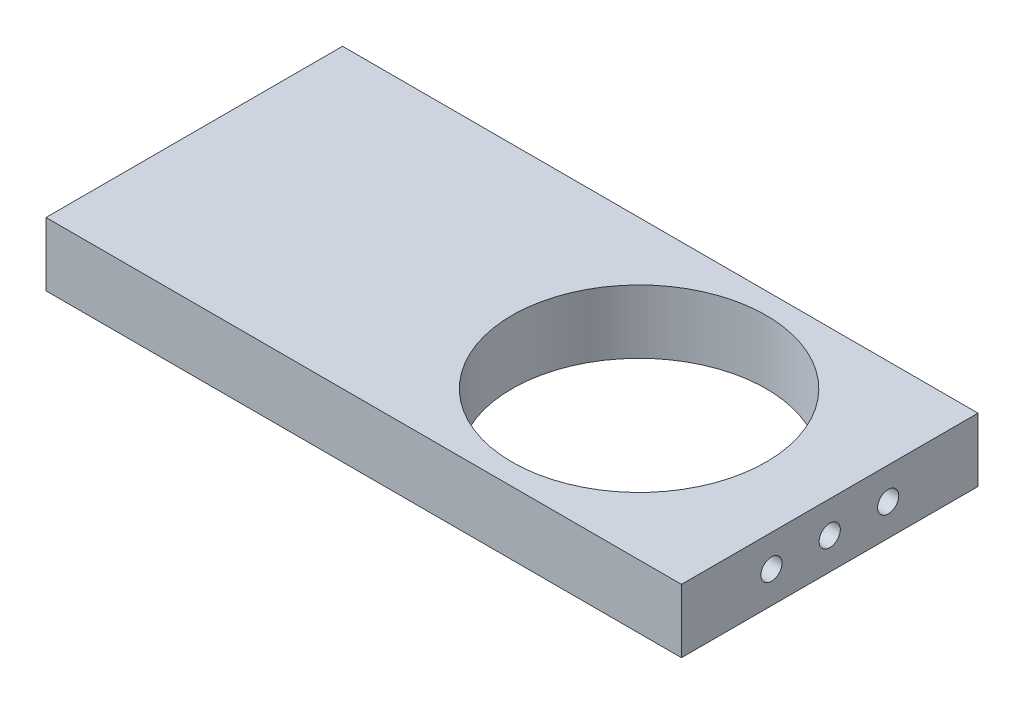
ISO-10303-21;
HEADER;
FILE_DESCRIPTION(('STEP AP214'),'2;1');
FILE_NAME('part.step','',(''),(''),'','','');
FILE_SCHEMA(('AUTOMOTIVE_DESIGN { 1 0 10303 214 1 1 1 1 }'));
ENDSEC;
DATA;
#1=APPLICATION_CONTEXT('core data for automotive mechanical design processes');
#2=APPLICATION_PROTOCOL_DEFINITION('international standard','automotive_design',2000,#1);
#3=PRODUCT_CONTEXT('',#1,'mechanical');
#4=PRODUCT('Part','Part','',(#3));
#5=PRODUCT_RELATED_PRODUCT_CATEGORY('part','',(#4));
#6=PRODUCT_DEFINITION_FORMATION('','',#4);
#7=PRODUCT_DEFINITION_CONTEXT('part definition',#1,'design');
#8=PRODUCT_DEFINITION('design','',#6,#7);
#9=PRODUCT_DEFINITION_SHAPE('','',#8);
#10=(LENGTH_UNIT() NAMED_UNIT(*) SI_UNIT(.MILLI.,.METRE.));
#11=(NAMED_UNIT(*) PLANE_ANGLE_UNIT() SI_UNIT($,.RADIAN.));
#12=(NAMED_UNIT(*) SI_UNIT($,.STERADIAN.) SOLID_ANGLE_UNIT());
#13=UNCERTAINTY_MEASURE_WITH_UNIT(LENGTH_MEASURE(1.E-05),#10,'distance_accuracy_value','');
#14=(GEOMETRIC_REPRESENTATION_CONTEXT(3) GLOBAL_UNCERTAINTY_ASSIGNED_CONTEXT((#13)) GLOBAL_UNIT_ASSIGNED_CONTEXT((#10,
#11,#12)) REPRESENTATION_CONTEXT('',''));
#15=CARTESIAN_POINT('',(0.,0.,0.));
#16=DIRECTION('',(0.,0.,1.));
#17=DIRECTION('',(1.,0.,0.));
#18=AXIS2_PLACEMENT_3D('',#15,#16,#17);
#19=CARTESIAN_POINT('',(-95.25,9.525,-44.45));
#20=DIRECTION('',(1.,0.,0.));
#21=DIRECTION('',(0.,0.,-1.));
#22=AXIS2_PLACEMENT_3D('',#19,#20,#21);
#23=PLANE('',#22);
#24=CARTESIAN_POINT('',(-95.25,0.,17.4625));
#25=DIRECTION('',(1.,0.,0.));
#26=DIRECTION('',(0.,0.,-1.));
#27=AXIS2_PLACEMENT_3D('',#24,#25,#26);
#28=CIRCLE('',#27,3.175);
#29=CARTESIAN_POINT('',(-95.25,0.,14.2875));
#30=VERTEX_POINT('',#29);
#31=EDGE_CURVE('E142',#30,#30,#28,.T.);
#32=ORIENTED_EDGE('',*,*,#31,.T.);
#33=EDGE_LOOP('',(#32));
#34=FACE_BOUND('',#33,.T.);
#35=DIRECTION('',(0.,0.,1.));
#36=VECTOR('',#35,1.);
#37=CARTESIAN_POINT('',(-95.25,-9.525,-44.45));
#38=LINE('',#37,#36);
#39=CARTESIAN_POINT('',(-95.25,-9.525,-44.45));
#40=VERTEX_POINT('',#39);
#41=CARTESIAN_POINT('',(-95.25,-9.525,44.45));
#42=VERTEX_POINT('',#41);
#43=EDGE_CURVE('E66',#40,#42,#38,.T.);
#44=ORIENTED_EDGE('',*,*,#43,.T.);
#45=DIRECTION('',(0.,-1.,0.));
#46=VECTOR('',#45,1.);
#47=CARTESIAN_POINT('',(-95.25,9.525,44.45));
#48=LINE('',#47,#46);
#49=CARTESIAN_POINT('',(-95.25,9.525,44.45));
#50=VERTEX_POINT('',#49);
#51=EDGE_CURVE('E90',#50,#42,#48,.T.);
#52=ORIENTED_EDGE('',*,*,#51,.F.);
#53=DIRECTION('',(0.,0.,1.));
#54=VECTOR('',#53,1.);
#55=CARTESIAN_POINT('',(-95.25,9.525,-44.45));
#56=LINE('',#55,#54);
#57=CARTESIAN_POINT('',(-95.25,9.525,-44.45));
#58=VERTEX_POINT('',#57);
#59=EDGE_CURVE('E83',#58,#50,#56,.T.);
#60=ORIENTED_EDGE('',*,*,#59,.F.);
#61=DIRECTION('',(0.,-1.,0.));
#62=VECTOR('',#61,1.);
#63=CARTESIAN_POINT('',(-95.25,9.525,-44.45));
#64=LINE('',#63,#62);
#65=EDGE_CURVE('E41',#58,#40,#64,.T.);
#66=ORIENTED_EDGE('',*,*,#65,.T.);
#67=EDGE_LOOP('',(#44,#52,#60,#66));
#68=FACE_BOUND('',#67,.T.);
#69=CARTESIAN_POINT('',(-95.25,0.,0.));
#70=DIRECTION('',(1.,0.,0.));
#71=DIRECTION('',(0.,0.,-1.));
#72=AXIS2_PLACEMENT_3D('',#69,#70,#71);
#73=CIRCLE('',#72,3.175);
#74=CARTESIAN_POINT('',(-95.25,0.,-3.175));
#75=VERTEX_POINT('',#74);
#76=EDGE_CURVE('E136',#75,#75,#73,.T.);
#77=ORIENTED_EDGE('',*,*,#76,.T.);
#78=EDGE_LOOP('',(#77));
#79=FACE_BOUND('',#78,.T.);
#80=CARTESIAN_POINT('',(-95.25,0.,-17.526));
#81=DIRECTION('',(1.,0.,0.));
#82=DIRECTION('',(0.,0.,-1.));
#83=AXIS2_PLACEMENT_3D('',#80,#81,#82);
#84=CIRCLE('',#83,3.175);
#85=CARTESIAN_POINT('',(-95.25,0.,-20.701));
#86=VERTEX_POINT('',#85);
#87=EDGE_CURVE('E148',#86,#86,#84,.T.);
#88=ORIENTED_EDGE('',*,*,#87,.T.);
#89=EDGE_LOOP('',(#88));
#90=FACE_BOUND('',#89,.T.);
#91=ADVANCED_FACE('F32',(#34,#68,#79,#90),#23,.F.);
#92=CARTESIAN_POINT('',(0.,9.525,0.));
#93=DIRECTION('',(0.,1.,0.));
#94=DIRECTION('',(0.,0.,1.));
#95=AXIS2_PLACEMENT_3D('',#92,#93,#94);
#96=PLANE('',#95);
#97=DIRECTION('',(0.,0.,-1.));
#98=VECTOR('',#97,1.);
#99=CARTESIAN_POINT('',(95.25,9.525,-44.45));
#100=LINE('',#99,#98);
#101=CARTESIAN_POINT('',(95.25,9.525,44.45));
#102=VERTEX_POINT('',#101);
#103=CARTESIAN_POINT('',(95.25,9.525,-44.45));
#104=VERTEX_POINT('',#103);
#105=EDGE_CURVE('E85',#102,#104,#100,.T.);
#106=ORIENTED_EDGE('',*,*,#105,.T.);
#107=DIRECTION('',(-1.,0.,0.));
#108=VECTOR('',#107,1.);
#109=CARTESIAN_POINT('',(-95.25,9.525,-44.45));
#110=LINE('',#109,#108);
#111=EDGE_CURVE('E79',#104,#58,#110,.T.);
#112=ORIENTED_EDGE('',*,*,#111,.T.);
#113=ORIENTED_EDGE('',*,*,#59,.T.);
#114=DIRECTION('',(1.,0.,0.));
#115=VECTOR('',#114,1.);
#116=CARTESIAN_POINT('',(-95.25,9.525,44.45));
#117=LINE('',#116,#115);
#118=EDGE_CURVE('E49',#50,#102,#117,.T.);
#119=ORIENTED_EDGE('',*,*,#118,.T.);
#120=EDGE_LOOP('',(#106,#112,#113,#119));
#121=FACE_BOUND('',#120,.T.);
#122=CARTESIAN_POINT('',(38.1,9.525,0.));
#123=DIRECTION('',(0.,1.,0.));
#124=DIRECTION('',(0.,0.,1.));
#125=AXIS2_PLACEMENT_3D('',#122,#123,#124);
#126=CIRCLE('',#125,38.1);
#127=CARTESIAN_POINT('',(38.1,9.525,38.1));
#128=VERTEX_POINT('',#127);
#129=EDGE_CURVE('E100',#128,#128,#126,.T.);
#130=ORIENTED_EDGE('',*,*,#129,.F.);
#131=EDGE_LOOP('',(#130));
#132=FACE_BOUND('',#131,.T.);
#133=ADVANCED_FACE('F80',(#121,#132),#96,.T.);
#134=CARTESIAN_POINT('',(0.,-9.525,0.));
#135=DIRECTION('',(0.,1.,0.));
#136=DIRECTION('',(0.,0.,1.));
#137=AXIS2_PLACEMENT_3D('',#134,#135,#136);
#138=PLANE('',#137);
#139=DIRECTION('',(0.,0.,-1.));
#140=VECTOR('',#139,1.);
#141=CARTESIAN_POINT('',(95.25,-9.525,-44.45));
#142=LINE('',#141,#140);
#143=CARTESIAN_POINT('',(95.25,-9.525,44.45));
#144=VERTEX_POINT('',#143);
#145=CARTESIAN_POINT('',(95.25,-9.525,-44.45));
#146=VERTEX_POINT('',#145);
#147=EDGE_CURVE('E97',#144,#146,#142,.T.);
#148=ORIENTED_EDGE('',*,*,#147,.F.);
#149=DIRECTION('',(1.,0.,0.));
#150=VECTOR('',#149,1.);
#151=CARTESIAN_POINT('',(-95.25,-9.525,44.45));
#152=LINE('',#151,#150);
#153=EDGE_CURVE('E72',#42,#144,#152,.T.);
#154=ORIENTED_EDGE('',*,*,#153,.F.);
#155=ORIENTED_EDGE('',*,*,#43,.F.);
#156=DIRECTION('',(-1.,0.,0.));
#157=VECTOR('',#156,1.);
#158=CARTESIAN_POINT('',(-95.25,-9.525,-44.45));
#159=LINE('',#158,#157);
#160=EDGE_CURVE('E89',#146,#40,#159,.T.);
#161=ORIENTED_EDGE('',*,*,#160,.F.);
#162=EDGE_LOOP('',(#148,#154,#155,#161));
#163=FACE_BOUND('',#162,.T.);
#164=CARTESIAN_POINT('',(38.1,-9.525,0.));
#165=DIRECTION('',(0.,1.,0.));
#166=DIRECTION('',(0.,0.,1.));
#167=AXIS2_PLACEMENT_3D('',#164,#165,#166);
#168=CIRCLE('',#167,38.1);
#169=CARTESIAN_POINT('',(38.1,-9.525,38.1));
#170=VERTEX_POINT('',#169);
#171=EDGE_CURVE('E112',#170,#170,#168,.T.);
#172=ORIENTED_EDGE('',*,*,#171,.T.);
#173=EDGE_LOOP('',(#172));
#174=FACE_BOUND('',#173,.T.);
#175=ADVANCED_FACE('F108',(#163,#174),#138,.F.);
#176=CARTESIAN_POINT('',(95.25,9.525,-44.45));
#177=DIRECTION('',(-1.,0.,0.));
#178=DIRECTION('',(0.,0.,1.));
#179=AXIS2_PLACEMENT_3D('',#176,#177,#178);
#180=PLANE('',#179);
#181=CARTESIAN_POINT('',(95.25,0.,-17.526));
#182=DIRECTION('',(1.,0.,0.));
#183=DIRECTION('',(0.,0.,-1.));
#184=AXIS2_PLACEMENT_3D('',#181,#182,#183);
#185=CIRCLE('',#184,3.175);
#186=CARTESIAN_POINT('',(95.25,0.,-20.701));
#187=VERTEX_POINT('',#186);
#188=EDGE_CURVE('E130',#187,#187,#185,.T.);
#189=ORIENTED_EDGE('',*,*,#188,.F.);
#190=EDGE_LOOP('',(#189));
#191=FACE_BOUND('',#190,.T.);
#192=CARTESIAN_POINT('',(95.25,0.,17.4625));
#193=DIRECTION('',(1.,0.,0.));
#194=DIRECTION('',(0.,0.,-1.));
#195=AXIS2_PLACEMENT_3D('',#192,#193,#194);
#196=CIRCLE('',#195,3.175);
#197=CARTESIAN_POINT('',(95.25,0.,14.2875));
#198=VERTEX_POINT('',#197);
#199=EDGE_CURVE('E124',#198,#198,#196,.T.);
#200=ORIENTED_EDGE('',*,*,#199,.F.);
#201=EDGE_LOOP('',(#200));
#202=FACE_BOUND('',#201,.T.);
#203=CARTESIAN_POINT('',(95.25,0.,0.));
#204=DIRECTION('',(1.,0.,0.));
#205=DIRECTION('',(0.,0.,-1.));
#206=AXIS2_PLACEMENT_3D('',#203,#204,#205);
#207=CIRCLE('',#206,3.175);
#208=CARTESIAN_POINT('',(95.25,0.,-3.175));
#209=VERTEX_POINT('',#208);
#210=EDGE_CURVE('E118',#209,#209,#207,.T.);
#211=ORIENTED_EDGE('',*,*,#210,.F.);
#212=EDGE_LOOP('',(#211));
#213=FACE_BOUND('',#212,.T.);
#214=ORIENTED_EDGE('',*,*,#147,.T.);
#215=DIRECTION('',(0.,-1.,0.));
#216=VECTOR('',#215,1.);
#217=CARTESIAN_POINT('',(95.25,9.525,-44.45));
#218=LINE('',#217,#216);
#219=EDGE_CURVE('E11',#104,#146,#218,.T.);
#220=ORIENTED_EDGE('',*,*,#219,.F.);
#221=ORIENTED_EDGE('',*,*,#105,.F.);
#222=DIRECTION('',(0.,-1.,0.));
#223=VECTOR('',#222,1.);
#224=CARTESIAN_POINT('',(95.25,9.525,44.45));
#225=LINE('',#224,#223);
#226=EDGE_CURVE('E93',#102,#144,#225,.T.);
#227=ORIENTED_EDGE('',*,*,#226,.T.);
#228=EDGE_LOOP('',(#214,#220,#221,#227));
#229=FACE_BOUND('',#228,.T.);
#230=ADVANCED_FACE('F34',(#191,#202,#213,#229),#180,.F.);
#231=CARTESIAN_POINT('',(-95.25,9.525,-44.45));
#232=DIRECTION('',(0.,0.,1.));
#233=DIRECTION('',(1.,0.,0.));
#234=AXIS2_PLACEMENT_3D('',#231,#232,#233);
#235=PLANE('',#234);
#236=ORIENTED_EDGE('',*,*,#160,.T.);
#237=ORIENTED_EDGE('',*,*,#65,.F.);
#238=ORIENTED_EDGE('',*,*,#111,.F.);
#239=ORIENTED_EDGE('',*,*,#219,.T.);
#240=EDGE_LOOP('',(#236,#237,#238,#239));
#241=FACE_BOUND('',#240,.T.);
#242=ADVANCED_FACE('F88',(#241),#235,.F.);
#243=CARTESIAN_POINT('',(-95.25,9.525,44.45));
#244=DIRECTION('',(0.,0.,-1.));
#245=DIRECTION('',(-1.,0.,0.));
#246=AXIS2_PLACEMENT_3D('',#243,#244,#245);
#247=PLANE('',#246);
#248=ORIENTED_EDGE('',*,*,#153,.T.);
#249=ORIENTED_EDGE('',*,*,#226,.F.);
#250=ORIENTED_EDGE('',*,*,#118,.F.);
#251=ORIENTED_EDGE('',*,*,#51,.T.);
#252=EDGE_LOOP('',(#248,#249,#250,#251));
#253=FACE_BOUND('',#252,.T.);
#254=ADVANCED_FACE('F105',(#253),#247,.F.);
#255=CARTESIAN_POINT('',(38.1,9.525,0.));
#256=DIRECTION('',(0.,-1.,0.));
#257=DIRECTION('',(0.,0.,-1.));
#258=AXIS2_PLACEMENT_3D('',#255,#256,#257);
#259=CYLINDRICAL_SURFACE('',#258,38.1);
#260=ORIENTED_EDGE('',*,*,#129,.T.);
#261=EDGE_LOOP('',(#260));
#262=FACE_BOUND('',#261,.T.);
#263=ORIENTED_EDGE('',*,*,#171,.F.);
#264=EDGE_LOOP('',(#263));
#265=FACE_BOUND('',#264,.T.);
#266=ADVANCED_FACE('F179',(#262,#265),#259,.F.);
#267=CARTESIAN_POINT('',(82.55,0.,0.));
#268=DIRECTION('',(1.,0.,0.));
#269=DIRECTION('',(0.,0.,-1.));
#270=AXIS2_PLACEMENT_3D('',#267,#268,#269);
#271=CYLINDRICAL_SURFACE('',#270,3.175);
#272=CARTESIAN_POINT('',(82.55,0.,0.));
#273=DIRECTION('',(1.,0.,0.));
#274=DIRECTION('',(0.,0.,-1.));
#275=AXIS2_PLACEMENT_3D('',#272,#273,#274);
#276=CIRCLE('',#275,3.175);
#277=CARTESIAN_POINT('',(82.55,0.,-3.175));
#278=VERTEX_POINT('',#277);
#279=EDGE_CURVE('E115',#278,#278,#276,.T.);
#280=ORIENTED_EDGE('',*,*,#279,.F.);
#281=EDGE_LOOP('',(#280));
#282=FACE_BOUND('',#281,.T.);
#283=ORIENTED_EDGE('',*,*,#210,.T.);
#284=EDGE_LOOP('',(#283));
#285=FACE_BOUND('',#284,.T.);
#286=ADVANCED_FACE('F190',(#282,#285),#271,.F.);
#287=CARTESIAN_POINT('',(82.55,0.,0.));
#288=DIRECTION('',(1.,0.,0.));
#289=DIRECTION('',(0.,0.,-1.));
#290=AXIS2_PLACEMENT_3D('',#287,#288,#289);
#291=PLANE('',#290);
#292=ORIENTED_EDGE('',*,*,#279,.T.);
#293=EDGE_LOOP('',(#292));
#294=FACE_BOUND('',#293,.T.);
#295=ADVANCED_FACE('F192',(#294),#291,.T.);
#296=CARTESIAN_POINT('',(82.55,0.,17.4625));
#297=DIRECTION('',(1.,0.,0.));
#298=DIRECTION('',(0.,0.,-1.));
#299=AXIS2_PLACEMENT_3D('',#296,#297,#298);
#300=CYLINDRICAL_SURFACE('',#299,3.175);
#301=CARTESIAN_POINT('',(82.55,0.,17.4625));
#302=DIRECTION('',(1.,0.,0.));
#303=DIRECTION('',(0.,0.,-1.));
#304=AXIS2_PLACEMENT_3D('',#301,#302,#303);
#305=CIRCLE('',#304,3.175);
#306=CARTESIAN_POINT('',(82.55,0.,14.2875));
#307=VERTEX_POINT('',#306);
#308=EDGE_CURVE('E121',#307,#307,#305,.T.);
#309=ORIENTED_EDGE('',*,*,#308,.F.);
#310=EDGE_LOOP('',(#309));
#311=FACE_BOUND('',#310,.T.);
#312=ORIENTED_EDGE('',*,*,#199,.T.);
#313=EDGE_LOOP('',(#312));
#314=FACE_BOUND('',#313,.T.);
#315=ADVANCED_FACE('F199',(#311,#314),#300,.F.);
#316=CARTESIAN_POINT('',(82.55,0.,17.4625));
#317=DIRECTION('',(1.,0.,0.));
#318=DIRECTION('',(0.,0.,-1.));
#319=AXIS2_PLACEMENT_3D('',#316,#317,#318);
#320=PLANE('',#319);
#321=ORIENTED_EDGE('',*,*,#308,.T.);
#322=EDGE_LOOP('',(#321));
#323=FACE_BOUND('',#322,.T.);
#324=ADVANCED_FACE('F208',(#323),#320,.T.);
#325=CARTESIAN_POINT('',(82.55,0.,-17.526));
#326=DIRECTION('',(1.,0.,0.));
#327=DIRECTION('',(0.,0.,-1.));
#328=AXIS2_PLACEMENT_3D('',#325,#326,#327);
#329=CYLINDRICAL_SURFACE('',#328,3.175);
#330=CARTESIAN_POINT('',(82.55,0.,-17.526));
#331=DIRECTION('',(1.,0.,0.));
#332=DIRECTION('',(0.,0.,-1.));
#333=AXIS2_PLACEMENT_3D('',#330,#331,#332);
#334=CIRCLE('',#333,3.175);
#335=CARTESIAN_POINT('',(82.55,0.,-20.701));
#336=VERTEX_POINT('',#335);
#337=EDGE_CURVE('E127',#336,#336,#334,.T.);
#338=ORIENTED_EDGE('',*,*,#337,.F.);
#339=EDGE_LOOP('',(#338));
#340=FACE_BOUND('',#339,.T.);
#341=ORIENTED_EDGE('',*,*,#188,.T.);
#342=EDGE_LOOP('',(#341));
#343=FACE_BOUND('',#342,.T.);
#344=ADVANCED_FACE('F212',(#340,#343),#329,.F.);
#345=CARTESIAN_POINT('',(82.55,0.,-17.526));
#346=DIRECTION('',(1.,0.,0.));
#347=DIRECTION('',(0.,0.,-1.));
#348=AXIS2_PLACEMENT_3D('',#345,#346,#347);
#349=PLANE('',#348);
#350=ORIENTED_EDGE('',*,*,#337,.T.);
#351=EDGE_LOOP('',(#350));
#352=FACE_BOUND('',#351,.T.);
#353=ADVANCED_FACE('F216',(#352),#349,.T.);
#354=CARTESIAN_POINT('',(-82.55,0.,0.));
#355=DIRECTION('',(-1.,0.,0.));
#356=DIRECTION('',(0.,0.,1.));
#357=AXIS2_PLACEMENT_3D('',#354,#355,#356);
#358=CYLINDRICAL_SURFACE('',#357,3.175);
#359=CARTESIAN_POINT('',(-82.55,0.,0.));
#360=DIRECTION('',(1.,0.,0.));
#361=DIRECTION('',(0.,0.,-1.));
#362=AXIS2_PLACEMENT_3D('',#359,#360,#361);
#363=CIRCLE('',#362,3.175);
#364=CARTESIAN_POINT('',(-82.55,0.,-3.175));
#365=VERTEX_POINT('',#364);
#366=EDGE_CURVE('E133',#365,#365,#363,.T.);
#367=ORIENTED_EDGE('',*,*,#366,.T.);
#368=EDGE_LOOP('',(#367));
#369=FACE_BOUND('',#368,.T.);
#370=ORIENTED_EDGE('',*,*,#76,.F.);
#371=EDGE_LOOP('',(#370));
#372=FACE_BOUND('',#371,.T.);
#373=ADVANCED_FACE('F220',(#369,#372),#358,.F.);
#374=CARTESIAN_POINT('',(-82.55,0.,0.));
#375=DIRECTION('',(-1.,0.,0.));
#376=DIRECTION('',(0.,0.,-1.));
#377=AXIS2_PLACEMENT_3D('',#374,#375,#376);
#378=PLANE('',#377);
#379=ORIENTED_EDGE('',*,*,#366,.F.);
#380=EDGE_LOOP('',(#379));
#381=FACE_BOUND('',#380,.T.);
#382=ADVANCED_FACE('F224',(#381),#378,.T.);
#383=CARTESIAN_POINT('',(-82.55,0.,17.4625));
#384=DIRECTION('',(-1.,0.,0.));
#385=DIRECTION('',(0.,0.,1.));
#386=AXIS2_PLACEMENT_3D('',#383,#384,#385);
#387=CYLINDRICAL_SURFACE('',#386,3.175);
#388=CARTESIAN_POINT('',(-82.55,0.,17.4625));
#389=DIRECTION('',(1.,0.,0.));
#390=DIRECTION('',(0.,0.,-1.));
#391=AXIS2_PLACEMENT_3D('',#388,#389,#390);
#392=CIRCLE('',#391,3.175);
#393=CARTESIAN_POINT('',(-82.55,0.,14.2875));
#394=VERTEX_POINT('',#393);
#395=EDGE_CURVE('E139',#394,#394,#392,.T.);
#396=ORIENTED_EDGE('',*,*,#395,.T.);
#397=EDGE_LOOP('',(#396));
#398=FACE_BOUND('',#397,.T.);
#399=ORIENTED_EDGE('',*,*,#31,.F.);
#400=EDGE_LOOP('',(#399));
#401=FACE_BOUND('',#400,.T.);
#402=ADVANCED_FACE('F228',(#398,#401),#387,.F.);
#403=CARTESIAN_POINT('',(-82.55,0.,17.4625));
#404=DIRECTION('',(-1.,0.,0.));
#405=DIRECTION('',(0.,0.,-1.));
#406=AXIS2_PLACEMENT_3D('',#403,#404,#405);
#407=PLANE('',#406);
#408=ORIENTED_EDGE('',*,*,#395,.F.);
#409=EDGE_LOOP('',(#408));
#410=FACE_BOUND('',#409,.T.);
#411=ADVANCED_FACE('F163',(#410),#407,.T.);
#412=CARTESIAN_POINT('',(-82.55,0.,-17.526));
#413=DIRECTION('',(-1.,0.,0.));
#414=DIRECTION('',(0.,0.,1.));
#415=AXIS2_PLACEMENT_3D('',#412,#413,#414);
#416=CYLINDRICAL_SURFACE('',#415,3.175);
#417=CARTESIAN_POINT('',(-82.55,0.,-17.526));
#418=DIRECTION('',(1.,0.,0.));
#419=DIRECTION('',(0.,0.,-1.));
#420=AXIS2_PLACEMENT_3D('',#417,#418,#419);
#421=CIRCLE('',#420,3.175);
#422=CARTESIAN_POINT('',(-82.55,0.,-20.701));
#423=VERTEX_POINT('',#422);
#424=EDGE_CURVE('E145',#423,#423,#421,.T.);
#425=ORIENTED_EDGE('',*,*,#424,.T.);
#426=EDGE_LOOP('',(#425));
#427=FACE_BOUND('',#426,.T.);
#428=ORIENTED_EDGE('',*,*,#87,.F.);
#429=EDGE_LOOP('',(#428));
#430=FACE_BOUND('',#429,.T.);
#431=ADVANCED_FACE('F154',(#427,#430),#416,.F.);
#432=CARTESIAN_POINT('',(-82.55,0.,-17.526));
#433=DIRECTION('',(-1.,0.,0.));
#434=DIRECTION('',(0.,0.,-1.));
#435=AXIS2_PLACEMENT_3D('',#432,#433,#434);
#436=PLANE('',#435);
#437=ORIENTED_EDGE('',*,*,#424,.F.);
#438=EDGE_LOOP('',(#437));
#439=FACE_BOUND('',#438,.T.);
#440=ADVANCED_FACE('F157',(#439),#436,.T.);
#441=CLOSED_SHELL('',(#91,#133,#175,#230,#242,#254,#266,#286,#295,#315,#324,#344,#353,#373,#382,
#402,#411,#431,#440));
#442=MANIFOLD_SOLID_BREP('B2',#441);
#443=ADVANCED_BREP_SHAPE_REPRESENTATION('',(#18,#442),#14);
#444=SHAPE_DEFINITION_REPRESENTATION(#9,#443);
ENDSEC;
END-ISO-10303-21;
